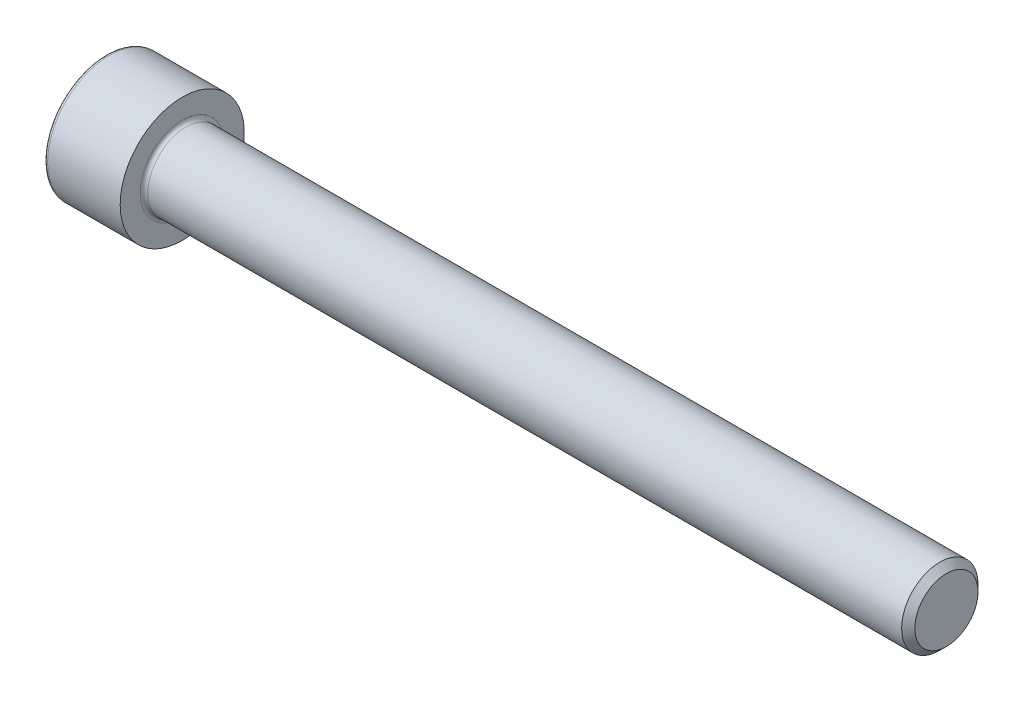
ISO-10303-21;
HEADER;
FILE_DESCRIPTION(('STEP AP214'),'2;1');
FILE_NAME('part.step','',(''),(''),'','','');
FILE_SCHEMA(('AUTOMOTIVE_DESIGN { 1 0 10303 214 1 1 1 1 }'));
ENDSEC;
DATA;
#1=APPLICATION_CONTEXT('core data for automotive mechanical design processes');
#2=APPLICATION_PROTOCOL_DEFINITION('international standard','automotive_design',2000,#1);
#3=PRODUCT_CONTEXT('',#1,'mechanical');
#4=PRODUCT('Part','Part','',(#3));
#5=PRODUCT_RELATED_PRODUCT_CATEGORY('part','',(#4));
#6=PRODUCT_DEFINITION_FORMATION('','',#4);
#7=PRODUCT_DEFINITION_CONTEXT('part definition',#1,'design');
#8=PRODUCT_DEFINITION('design','',#6,#7);
#9=PRODUCT_DEFINITION_SHAPE('','',#8);
#10=(LENGTH_UNIT() NAMED_UNIT(*) SI_UNIT(.MILLI.,.METRE.));
#11=(NAMED_UNIT(*) PLANE_ANGLE_UNIT() SI_UNIT($,.RADIAN.));
#12=(NAMED_UNIT(*) SI_UNIT($,.STERADIAN.) SOLID_ANGLE_UNIT());
#13=UNCERTAINTY_MEASURE_WITH_UNIT(LENGTH_MEASURE(1.E-05),#10,'distance_accuracy_value','');
#14=(GEOMETRIC_REPRESENTATION_CONTEXT(3) GLOBAL_UNCERTAINTY_ASSIGNED_CONTEXT((#13)) GLOBAL_UNIT_ASSIGNED_CONTEXT((#10,
#11,#12)) REPRESENTATION_CONTEXT('',''));
#15=CARTESIAN_POINT('',(0.,0.,0.));
#16=DIRECTION('',(0.,0.,1.));
#17=DIRECTION('',(1.,0.,0.));
#18=AXIS2_PLACEMENT_3D('',#15,#16,#17);
#19=CARTESIAN_POINT('',(0.,0.,0.));
#20=DIRECTION('',(-1.,0.,0.));
#21=DIRECTION('',(0.,0.,1.));
#22=AXIS2_PLACEMENT_3D('',#19,#20,#21);
#23=PLANE('',#22);
#24=DIRECTION('',(0.,-0.499999999999999,0.866025403784439));
#25=VECTOR('',#24,1.);
#26=CARTESIAN_POINT('',(0.,3.51894989071077,0.));
#27=LINE('',#26,#25);
#28=CARTESIAN_POINT('',(0.,3.51894989071077,0.));
#29=VERTEX_POINT('',#28);
#30=CARTESIAN_POINT('',(0.,1.75947494535539,3.04749999999999));
#31=VERTEX_POINT('',#30);
#32=EDGE_CURVE('E260',#29,#31,#27,.T.);
#33=ORIENTED_EDGE('',*,*,#32,.T.);
#34=DIRECTION('',(0.,1.,0.));
#35=VECTOR('',#34,1.);
#36=CARTESIAN_POINT('',(0.,-1.75947494535539,3.0475));
#37=LINE('',#36,#35);
#38=CARTESIAN_POINT('',(0.,-1.75947494535539,3.0475));
#39=VERTEX_POINT('',#38);
#40=EDGE_CURVE('E132',#39,#31,#37,.T.);
#41=ORIENTED_EDGE('',*,*,#40,.F.);
#42=DIRECTION('',(0.,-0.500000000000001,-0.866025403784438));
#43=VECTOR('',#42,1.);
#44=CARTESIAN_POINT('',(0.,-1.75947494535539,3.0475));
#45=LINE('',#44,#43);
#46=CARTESIAN_POINT('',(0.,-3.51894989071077,0.));
#47=VERTEX_POINT('',#46);
#48=EDGE_CURVE('E263',#39,#47,#45,.T.);
#49=ORIENTED_EDGE('',*,*,#48,.T.);
#50=DIRECTION('',(0.,0.499999999999999,-0.866025403784439));
#51=VECTOR('',#50,1.);
#52=CARTESIAN_POINT('',(0.,-3.51894989071077,0.));
#53=LINE('',#52,#51);
#54=CARTESIAN_POINT('',(0.,-1.75947494535539,-3.0475));
#55=VERTEX_POINT('',#54);
#56=EDGE_CURVE('E266',#47,#55,#53,.T.);
#57=ORIENTED_EDGE('',*,*,#56,.T.);
#58=DIRECTION('',(0.,-1.,0.));
#59=VECTOR('',#58,1.);
#60=CARTESIAN_POINT('',(0.,1.75947494535538,-3.04750000000001));
#61=LINE('',#60,#59);
#62=CARTESIAN_POINT('',(0.,1.75947494535538,-3.04750000000001));
#63=VERTEX_POINT('',#62);
#64=EDGE_CURVE('E269',#63,#55,#61,.T.);
#65=ORIENTED_EDGE('',*,*,#64,.F.);
#66=DIRECTION('',(0.,-0.500000000000001,-0.866025403784438));
#67=VECTOR('',#66,1.);
#68=CARTESIAN_POINT('',(0.,3.51894989071077,0.));
#69=LINE('',#68,#67);
#70=EDGE_CURVE('E127',#29,#63,#69,.T.);
#71=ORIENTED_EDGE('',*,*,#70,.F.);
#72=EDGE_LOOP('',(#33,#41,#49,#57,#65,#71));
#73=FACE_BOUND('',#72,.T.);
#74=CARTESIAN_POINT('',(0.,0.,0.));
#75=DIRECTION('',(-1.,0.,0.));
#76=DIRECTION('',(0.,0.,1.));
#77=AXIS2_PLACEMENT_3D('',#74,#75,#76);
#78=CIRCLE('',#77,6.1);
#79=CARTESIAN_POINT('',(0.,0.,6.1));
#80=VERTEX_POINT('',#79);
#81=EDGE_CURVE('E44',#80,#80,#78,.T.);
#82=ORIENTED_EDGE('',*,*,#81,.T.);
#83=EDGE_LOOP('',(#82));
#84=FACE_BOUND('',#83,.T.);
#85=ADVANCED_FACE('F36',(#73,#84),#23,.T.);
#86=CARTESIAN_POINT('',(-31.75,0.,0.));
#87=DIRECTION('',(-1.,0.,0.));
#88=DIRECTION('',(0.,0.,1.));
#89=AXIS2_PLACEMENT_3D('',#86,#87,#88);
#90=CYLINDRICAL_SURFACE('',#89,6.5);
#91=CARTESIAN_POINT('',(0.399999999999998,0.,0.));
#92=DIRECTION('',(-1.,0.,0.));
#93=DIRECTION('',(0.,0.,1.));
#94=AXIS2_PLACEMENT_3D('',#91,#92,#93);
#95=CIRCLE('',#94,6.5);
#96=CARTESIAN_POINT('',(0.399999999999998,0.,6.5));
#97=VERTEX_POINT('',#96);
#98=EDGE_CURVE('E11',#97,#97,#95,.F.);
#99=ORIENTED_EDGE('',*,*,#98,.T.);
#100=EDGE_LOOP('',(#99));
#101=FACE_BOUND('',#100,.T.);
#102=CARTESIAN_POINT('',(8.,0.,0.));
#103=DIRECTION('',(-1.,0.,0.));
#104=DIRECTION('',(0.,0.,1.));
#105=AXIS2_PLACEMENT_3D('',#102,#103,#104);
#106=CIRCLE('',#105,6.5);
#107=CARTESIAN_POINT('',(8.,0.,6.5));
#108=VERTEX_POINT('',#107);
#109=EDGE_CURVE('E150',#108,#108,#106,.T.);
#110=ORIENTED_EDGE('',*,*,#109,.T.);
#111=EDGE_LOOP('',(#110));
#112=FACE_BOUND('',#111,.T.);
#113=ADVANCED_FACE('F174',(#101,#112),#90,.T.);
#114=CARTESIAN_POINT('',(8.,6.5,0.));
#115=DIRECTION('',(1.,0.,0.));
#116=DIRECTION('',(0.,0.,-1.));
#117=AXIS2_PLACEMENT_3D('',#114,#115,#116);
#118=PLANE('',#117);
#119=CARTESIAN_POINT('',(8.,0.,0.));
#120=DIRECTION('',(1.,0.,0.));
#121=DIRECTION('',(0.,0.,-1.));
#122=AXIS2_PLACEMENT_3D('',#119,#120,#121);
#123=CIRCLE('',#122,4.39999999999997);
#124=CARTESIAN_POINT('',(8.,0.,-4.39999999999997));
#125=VERTEX_POINT('',#124);
#126=EDGE_CURVE('E153',#125,#125,#123,.F.);
#127=ORIENTED_EDGE('',*,*,#126,.T.);
#128=EDGE_LOOP('',(#127));
#129=FACE_BOUND('',#128,.T.);
#130=ORIENTED_EDGE('',*,*,#109,.F.);
#131=EDGE_LOOP('',(#130));
#132=FACE_BOUND('',#131,.T.);
#133=ADVANCED_FACE('F180',(#129,#132),#118,.T.);
#134=CARTESIAN_POINT('',(-31.75,0.,0.));
#135=DIRECTION('',(-1.,0.,0.));
#136=DIRECTION('',(0.,0.,1.));
#137=AXIS2_PLACEMENT_3D('',#134,#135,#136);
#138=CYLINDRICAL_SURFACE('',#137,3.99999999999997);
#139=CARTESIAN_POINT('',(8.4,0.,0.));
#140=DIRECTION('',(1.,0.,0.));
#141=DIRECTION('',(0.,0.,-1.));
#142=AXIS2_PLACEMENT_3D('',#139,#140,#141);
#143=CIRCLE('',#142,3.99999999999997);
#144=CARTESIAN_POINT('',(8.4,0.,-3.99999999999997));
#145=VERTEX_POINT('',#144);
#146=EDGE_CURVE('E156',#145,#145,#143,.T.);
#147=ORIENTED_EDGE('',*,*,#146,.T.);
#148=EDGE_LOOP('',(#147));
#149=FACE_BOUND('',#148,.T.);
#150=CARTESIAN_POINT('',(87.3095,0.,0.));
#151=DIRECTION('',(-1.,0.,0.));
#152=DIRECTION('',(0.,0.,1.));
#153=AXIS2_PLACEMENT_3D('',#150,#151,#152);
#154=CIRCLE('',#153,3.99999999999994);
#155=CARTESIAN_POINT('',(87.3095,0.,3.99999999999994));
#156=VERTEX_POINT('',#155);
#157=EDGE_CURVE('E147',#156,#156,#154,.T.);
#158=ORIENTED_EDGE('',*,*,#157,.T.);
#159=EDGE_LOOP('',(#158));
#160=FACE_BOUND('',#159,.T.);
#161=ADVANCED_FACE('F186',(#149,#160),#138,.T.);
#162=CARTESIAN_POINT('',(88.,0.,0.));
#163=DIRECTION('',(-1.,0.,0.));
#164=DIRECTION('',(0.,0.,1.));
#165=AXIS2_PLACEMENT_3D('',#162,#163,#164);
#166=CONICAL_SURFACE('',#165,3.3095,0.785398163397397);
#167=ORIENTED_EDGE('',*,*,#157,.F.);
#168=EDGE_LOOP('',(#167));
#169=FACE_BOUND('',#168,.T.);
#170=CARTESIAN_POINT('',(88.,0.,0.));
#171=DIRECTION('',(-1.,0.,0.));
#172=DIRECTION('',(0.,0.,1.));
#173=AXIS2_PLACEMENT_3D('',#170,#171,#172);
#174=CIRCLE('',#173,3.3095);
#175=CARTESIAN_POINT('',(88.,0.,3.3095));
#176=VERTEX_POINT('',#175);
#177=EDGE_CURVE('E143',#176,#176,#174,.T.);
#178=ORIENTED_EDGE('',*,*,#177,.T.);
#179=EDGE_LOOP('',(#178));
#180=FACE_BOUND('',#179,.T.);
#181=ADVANCED_FACE('F190',(#169,#180),#166,.T.);
#182=CARTESIAN_POINT('',(88.,3.3095,0.));
#183=DIRECTION('',(1.,0.,0.));
#184=DIRECTION('',(0.,0.,-1.));
#185=AXIS2_PLACEMENT_3D('',#182,#183,#184);
#186=PLANE('',#185);
#187=ORIENTED_EDGE('',*,*,#177,.F.);
#188=EDGE_LOOP('',(#187));
#189=FACE_BOUND('',#188,.T.);
#190=ADVANCED_FACE('F170',(#189),#186,.T.);
#191=CARTESIAN_POINT('',(8.4,0.,0.));
#192=DIRECTION('',(1.,0.,0.));
#193=DIRECTION('',(0.,0.,-1.));
#194=AXIS2_PLACEMENT_3D('',#191,#192,#193);
#195=TOROIDAL_SURFACE('',#194,4.39999999999997,0.4);
#196=ORIENTED_EDGE('',*,*,#146,.F.);
#197=EDGE_LOOP('',(#196));
#198=FACE_BOUND('',#197,.T.);
#199=ORIENTED_EDGE('',*,*,#126,.F.);
#200=EDGE_LOOP('',(#199));
#201=FACE_BOUND('',#200,.T.);
#202=ADVANCED_FACE('F163',(#198,#201),#195,.F.);
#203=CARTESIAN_POINT('',(0.399999999999998,0.,0.));
#204=DIRECTION('',(-1.,0.,0.));
#205=DIRECTION('',(0.,0.,1.));
#206=AXIS2_PLACEMENT_3D('',#203,#204,#205);
#207=TOROIDAL_SURFACE('',#206,6.1,0.4);
#208=ORIENTED_EDGE('',*,*,#98,.F.);
#209=EDGE_LOOP('',(#208));
#210=FACE_BOUND('',#209,.T.);
#211=ORIENTED_EDGE('',*,*,#81,.F.);
#212=EDGE_LOOP('',(#211));
#213=FACE_BOUND('',#212,.T.);
#214=ADVANCED_FACE('F38',(#210,#213),#207,.T.);
#215=CARTESIAN_POINT('',(4.,3.51894989071077,0.));
#216=DIRECTION('',(0.,-0.866025403784439,-0.499999999999999));
#217=DIRECTION('',(0.,0.499999999999999,-0.866025403784439));
#218=AXIS2_PLACEMENT_3D('',#215,#216,#217);
#219=PLANE('',#218);
#220=ORIENTED_EDGE('',*,*,#32,.F.);
#221=DIRECTION('',(-1.,0.,0.));
#222=VECTOR('',#221,1.);
#223=CARTESIAN_POINT('',(4.,3.51894989071077,0.));
#224=LINE('',#223,#222);
#225=CARTESIAN_POINT('',(4.,3.51894989071077,0.));
#226=VERTEX_POINT('',#225);
#227=EDGE_CURVE('E250',#226,#29,#224,.T.);
#228=ORIENTED_EDGE('',*,*,#227,.F.);
#229=DIRECTION('',(0.,-0.499999999999999,0.866025403784439));
#230=VECTOR('',#229,1.);
#231=CARTESIAN_POINT('',(4.,3.51894989071077,0.));
#232=LINE('',#231,#230);
#233=CARTESIAN_POINT('',(4.,2.63921241803308,1.52375));
#234=VERTEX_POINT('',#233);
#235=EDGE_CURVE('E119',#226,#234,#232,.T.);
#236=ORIENTED_EDGE('',*,*,#235,.T.);
#237=CARTESIAN_POINT('',(4.,1.75947494535539,3.04749999999999));
#238=VERTEX_POINT('',#237);
#239=EDGE_CURVE('E110',#234,#238,#232,.T.);
#240=ORIENTED_EDGE('',*,*,#239,.T.);
#241=DIRECTION('',(-1.,0.,0.));
#242=VECTOR('',#241,1.);
#243=CARTESIAN_POINT('',(4.,1.75947494535539,3.04749999999999));
#244=LINE('',#243,#242);
#245=EDGE_CURVE('E124',#238,#31,#244,.T.);
#246=ORIENTED_EDGE('',*,*,#245,.T.);
#247=EDGE_LOOP('',(#220,#228,#236,#240,#246));
#248=FACE_BOUND('',#247,.T.);
#249=ADVANCED_FACE('F123',(#248),#219,.T.);
#250=CARTESIAN_POINT('',(4.,-1.75947494535539,3.0475));
#251=DIRECTION('',(0.,0.,1.));
#252=DIRECTION('',(0.,-1.,0.));
#253=AXIS2_PLACEMENT_3D('',#250,#251,#252);
#254=PLANE('',#253);
#255=ORIENTED_EDGE('',*,*,#40,.T.);
#256=ORIENTED_EDGE('',*,*,#245,.F.);
#257=DIRECTION('',(0.,1.,0.));
#258=VECTOR('',#257,1.);
#259=CARTESIAN_POINT('',(4.,-1.75947494535539,3.0475));
#260=LINE('',#259,#258);
#261=CARTESIAN_POINT('',(4.,0.,3.0475));
#262=VERTEX_POINT('',#261);
#263=EDGE_CURVE('E107',#262,#238,#260,.T.);
#264=ORIENTED_EDGE('',*,*,#263,.F.);
#265=CARTESIAN_POINT('',(4.,-1.75947494535539,3.0475));
#266=VERTEX_POINT('',#265);
#267=EDGE_CURVE('E118',#266,#262,#260,.T.);
#268=ORIENTED_EDGE('',*,*,#267,.F.);
#269=DIRECTION('',(-1.,0.,0.));
#270=VECTOR('',#269,1.);
#271=CARTESIAN_POINT('',(4.,-1.75947494535539,3.0475));
#272=LINE('',#271,#270);
#273=EDGE_CURVE('E134',#266,#39,#272,.T.);
#274=ORIENTED_EDGE('',*,*,#273,.T.);
#275=EDGE_LOOP('',(#255,#256,#264,#268,#274));
#276=FACE_BOUND('',#275,.T.);
#277=ADVANCED_FACE('F129',(#276),#254,.F.);
#278=CARTESIAN_POINT('',(4.,-1.75947494535539,3.0475));
#279=DIRECTION('',(0.,0.866025403784438,-0.500000000000001));
#280=DIRECTION('',(0.,0.500000000000001,0.866025403784438));
#281=AXIS2_PLACEMENT_3D('',#278,#279,#280);
#282=PLANE('',#281);
#283=ORIENTED_EDGE('',*,*,#48,.F.);
#284=ORIENTED_EDGE('',*,*,#273,.F.);
#285=DIRECTION('',(0.,-0.500000000000001,-0.866025403784438));
#286=VECTOR('',#285,1.);
#287=CARTESIAN_POINT('',(4.,-1.75947494535539,3.0475));
#288=LINE('',#287,#286);
#289=CARTESIAN_POINT('',(4.,-2.63921241803308,1.52375));
#290=VERTEX_POINT('',#289);
#291=EDGE_CURVE('E289',#266,#290,#288,.T.);
#292=ORIENTED_EDGE('',*,*,#291,.T.);
#293=CARTESIAN_POINT('',(4.,-3.51894989071077,0.));
#294=VERTEX_POINT('',#293);
#295=EDGE_CURVE('E278',#290,#294,#288,.T.);
#296=ORIENTED_EDGE('',*,*,#295,.T.);
#297=DIRECTION('',(-1.,0.,0.));
#298=VECTOR('',#297,1.);
#299=CARTESIAN_POINT('',(4.,-3.51894989071077,0.));
#300=LINE('',#299,#298);
#301=EDGE_CURVE('E139',#294,#47,#300,.T.);
#302=ORIENTED_EDGE('',*,*,#301,.T.);
#303=EDGE_LOOP('',(#283,#284,#292,#296,#302));
#304=FACE_BOUND('',#303,.T.);
#305=ADVANCED_FACE('F204',(#304),#282,.T.);
#306=CARTESIAN_POINT('',(4.,-3.51894989071077,0.));
#307=DIRECTION('',(0.,0.866025403784439,0.499999999999999));
#308=DIRECTION('',(0.,-0.499999999999999,0.866025403784439));
#309=AXIS2_PLACEMENT_3D('',#306,#307,#308);
#310=PLANE('',#309);
#311=ORIENTED_EDGE('',*,*,#56,.F.);
#312=ORIENTED_EDGE('',*,*,#301,.F.);
#313=DIRECTION('',(0.,0.499999999999999,-0.866025403784439));
#314=VECTOR('',#313,1.);
#315=CARTESIAN_POINT('',(4.,-3.51894989071077,0.));
#316=LINE('',#315,#314);
#317=CARTESIAN_POINT('',(4.,-2.63921241803308,-1.52375));
#318=VERTEX_POINT('',#317);
#319=EDGE_CURVE('E256',#294,#318,#316,.T.);
#320=ORIENTED_EDGE('',*,*,#319,.T.);
#321=CARTESIAN_POINT('',(4.,-1.75947494535539,-3.0475));
#322=VERTEX_POINT('',#321);
#323=EDGE_CURVE('E288',#318,#322,#316,.T.);
#324=ORIENTED_EDGE('',*,*,#323,.T.);
#325=DIRECTION('',(-1.,0.,0.));
#326=VECTOR('',#325,1.);
#327=CARTESIAN_POINT('',(4.,-1.75947494535539,-3.0475));
#328=LINE('',#327,#326);
#329=EDGE_CURVE('E249',#322,#55,#328,.T.);
#330=ORIENTED_EDGE('',*,*,#329,.T.);
#331=EDGE_LOOP('',(#311,#312,#320,#324,#330));
#332=FACE_BOUND('',#331,.T.);
#333=ADVANCED_FACE('F207',(#332),#310,.T.);
#334=CARTESIAN_POINT('',(4.,1.75947494535538,-3.04750000000001));
#335=DIRECTION('',(0.,0.,-1.));
#336=DIRECTION('',(0.,1.,0.));
#337=AXIS2_PLACEMENT_3D('',#334,#335,#336);
#338=PLANE('',#337);
#339=ORIENTED_EDGE('',*,*,#64,.T.);
#340=ORIENTED_EDGE('',*,*,#329,.F.);
#341=DIRECTION('',(0.,-1.,0.));
#342=VECTOR('',#341,1.);
#343=CARTESIAN_POINT('',(4.,1.75947494535538,-3.04750000000001));
#344=LINE('',#343,#342);
#345=CARTESIAN_POINT('',(4.,0.,-3.0475));
#346=VERTEX_POINT('',#345);
#347=EDGE_CURVE('E253',#346,#322,#344,.T.);
#348=ORIENTED_EDGE('',*,*,#347,.F.);
#349=CARTESIAN_POINT('',(4.,1.75947494535538,-3.04750000000001));
#350=VERTEX_POINT('',#349);
#351=EDGE_CURVE('E51',#350,#346,#344,.T.);
#352=ORIENTED_EDGE('',*,*,#351,.F.);
#353=DIRECTION('',(-1.,0.,0.));
#354=VECTOR('',#353,1.);
#355=CARTESIAN_POINT('',(4.,1.75947494535538,-3.04750000000001));
#356=LINE('',#355,#354);
#357=EDGE_CURVE('E246',#350,#63,#356,.T.);
#358=ORIENTED_EDGE('',*,*,#357,.T.);
#359=EDGE_LOOP('',(#339,#340,#348,#352,#358));
#360=FACE_BOUND('',#359,.T.);
#361=ADVANCED_FACE('F211',(#360),#338,.F.);
#362=CARTESIAN_POINT('',(4.,3.51894989071077,0.));
#363=DIRECTION('',(0.,0.866025403784438,-0.500000000000001));
#364=DIRECTION('',(0.,0.500000000000001,0.866025403784438));
#365=AXIS2_PLACEMENT_3D('',#362,#363,#364);
#366=PLANE('',#365);
#367=ORIENTED_EDGE('',*,*,#70,.T.);
#368=ORIENTED_EDGE('',*,*,#357,.F.);
#369=DIRECTION('',(0.,-0.500000000000001,-0.866025403784438));
#370=VECTOR('',#369,1.);
#371=CARTESIAN_POINT('',(4.,3.51894989071077,0.));
#372=LINE('',#371,#370);
#373=CARTESIAN_POINT('',(4.,2.63921241803307,-1.52375));
#374=VERTEX_POINT('',#373);
#375=EDGE_CURVE('E236',#374,#350,#372,.T.);
#376=ORIENTED_EDGE('',*,*,#375,.F.);
#377=EDGE_CURVE('E242',#226,#374,#372,.T.);
#378=ORIENTED_EDGE('',*,*,#377,.F.);
#379=ORIENTED_EDGE('',*,*,#227,.T.);
#380=EDGE_LOOP('',(#367,#368,#376,#378,#379));
#381=FACE_BOUND('',#380,.T.);
#382=ADVANCED_FACE('F215',(#381),#366,.F.);
#383=CARTESIAN_POINT('',(4.,3.51894989071077,0.));
#384=DIRECTION('',(1.,0.,0.));
#385=DIRECTION('',(0.,0.,-1.));
#386=AXIS2_PLACEMENT_3D('',#383,#384,#385);
#387=PLANE('',#386);
#388=ORIENTED_EDGE('',*,*,#347,.T.);
#389=ORIENTED_EDGE('',*,*,#323,.F.);
#390=CARTESIAN_POINT('',(4.,0.,0.));
#391=DIRECTION('',(-1.,0.,0.));
#392=DIRECTION('',(0.,0.,1.));
#393=AXIS2_PLACEMENT_3D('',#390,#391,#392);
#394=CIRCLE('',#393,3.0475);
#395=EDGE_CURVE('E284',#346,#318,#394,.T.);
#396=ORIENTED_EDGE('',*,*,#395,.F.);
#397=EDGE_LOOP('',(#388,#389,#396));
#398=FACE_BOUND('',#397,.T.);
#399=ADVANCED_FACE('F219',(#398),#387,.F.);
#400=ORIENTED_EDGE('',*,*,#319,.F.);
#401=ORIENTED_EDGE('',*,*,#295,.F.);
#402=EDGE_CURVE('E137',#318,#290,#394,.T.);
#403=ORIENTED_EDGE('',*,*,#402,.F.);
#404=EDGE_LOOP('',(#400,#401,#403));
#405=FACE_BOUND('',#404,.T.);
#406=ADVANCED_FACE('F222',(#405),#387,.F.);
#407=ORIENTED_EDGE('',*,*,#291,.F.);
#408=ORIENTED_EDGE('',*,*,#267,.T.);
#409=EDGE_CURVE('E133',#290,#262,#394,.T.);
#410=ORIENTED_EDGE('',*,*,#409,.F.);
#411=EDGE_LOOP('',(#407,#408,#410));
#412=FACE_BOUND('',#411,.T.);
#413=ADVANCED_FACE('F227',(#412),#387,.F.);
#414=ORIENTED_EDGE('',*,*,#263,.T.);
#415=ORIENTED_EDGE('',*,*,#239,.F.);
#416=EDGE_CURVE('E113',#262,#234,#394,.T.);
#417=ORIENTED_EDGE('',*,*,#416,.F.);
#418=EDGE_LOOP('',(#414,#415,#417));
#419=FACE_BOUND('',#418,.T.);
#420=ADVANCED_FACE('F109',(#419),#387,.F.);
#421=ORIENTED_EDGE('',*,*,#235,.F.);
#422=ORIENTED_EDGE('',*,*,#377,.T.);
#423=EDGE_CURVE('E144',#234,#374,#394,.T.);
#424=ORIENTED_EDGE('',*,*,#423,.F.);
#425=EDGE_LOOP('',(#421,#422,#424));
#426=FACE_BOUND('',#425,.T.);
#427=ADVANCED_FACE('F230',(#426),#387,.F.);
#428=ORIENTED_EDGE('',*,*,#375,.T.);
#429=ORIENTED_EDGE('',*,*,#351,.T.);
#430=EDGE_CURVE('E239',#374,#346,#394,.T.);
#431=ORIENTED_EDGE('',*,*,#430,.F.);
#432=EDGE_LOOP('',(#428,#429,#431));
#433=FACE_BOUND('',#432,.T.);
#434=ADVANCED_FACE('F200',(#433),#387,.F.);
#435=CARTESIAN_POINT('',(4.,0.,0.));
#436=DIRECTION('',(-1.,0.,0.));
#437=DIRECTION('',(0.,0.,1.));
#438=AXIS2_PLACEMENT_3D('',#435,#436,#437);
#439=CONICAL_SURFACE('',#438,3.0475,1.04719755119659);
#440=CARTESIAN_POINT('',(5.75947494535541,0.,0.));
#441=VERTEX_POINT('',#440);
#442=VERTEX_LOOP('',#441);
#443=FACE_BOUND('',#442,.T.);
#444=ORIENTED_EDGE('',*,*,#416,.T.);
#445=ORIENTED_EDGE('',*,*,#423,.T.);
#446=ORIENTED_EDGE('',*,*,#430,.T.);
#447=ORIENTED_EDGE('',*,*,#395,.T.);
#448=ORIENTED_EDGE('',*,*,#402,.T.);
#449=ORIENTED_EDGE('',*,*,#409,.T.);
#450=EDGE_LOOP('',(#444,#445,#446,#447,#448,#449));
#451=FACE_BOUND('',#450,.T.);
#452=ADVANCED_FACE('F198',(#443,#451),#439,.F.);
#453=CLOSED_SHELL('',(#85,#113,#133,#161,#181,#190,#202,#214,#249,#277,#305,#333,#361,#382,#399,
#406,#413,#420,#427,#434,#452));
#454=MANIFOLD_SOLID_BREP('B2',#453);
#455=ADVANCED_BREP_SHAPE_REPRESENTATION('',(#18,#454),#14);
#456=SHAPE_DEFINITION_REPRESENTATION(#9,#455);
ENDSEC;
END-ISO-10303-21;
